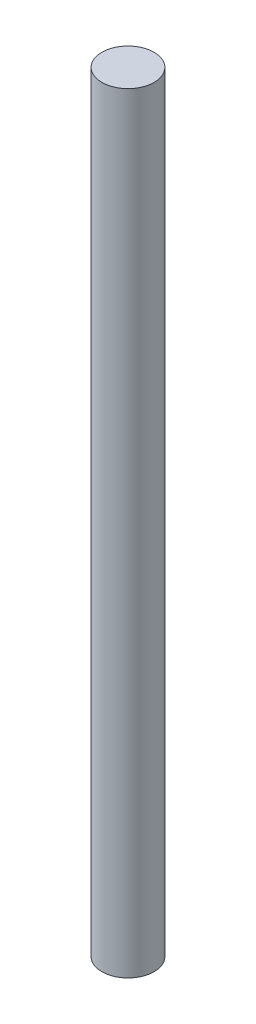
ISO-10303-21;
HEADER;
FILE_DESCRIPTION(('STEP AP214'),'2;1');
FILE_NAME('part.step','',(''),(''),'','','');
FILE_SCHEMA(('AUTOMOTIVE_DESIGN { 1 0 10303 214 1 1 1 1 }'));
ENDSEC;
DATA;
#1=APPLICATION_CONTEXT('core data for automotive mechanical design processes');
#2=APPLICATION_PROTOCOL_DEFINITION('international standard','automotive_design',2000,#1);
#3=PRODUCT_CONTEXT('',#1,'mechanical');
#4=PRODUCT('Part','Part','',(#3));
#5=PRODUCT_RELATED_PRODUCT_CATEGORY('part','',(#4));
#6=PRODUCT_DEFINITION_FORMATION('','',#4);
#7=PRODUCT_DEFINITION_CONTEXT('part definition',#1,'design');
#8=PRODUCT_DEFINITION('design','',#6,#7);
#9=PRODUCT_DEFINITION_SHAPE('','',#8);
#10=(LENGTH_UNIT() NAMED_UNIT(*) SI_UNIT(.MILLI.,.METRE.));
#11=(NAMED_UNIT(*) PLANE_ANGLE_UNIT() SI_UNIT($,.RADIAN.));
#12=(NAMED_UNIT(*) SI_UNIT($,.STERADIAN.) SOLID_ANGLE_UNIT());
#13=UNCERTAINTY_MEASURE_WITH_UNIT(LENGTH_MEASURE(1.E-05),#10,'distance_accuracy_value','');
#14=(GEOMETRIC_REPRESENTATION_CONTEXT(3) GLOBAL_UNCERTAINTY_ASSIGNED_CONTEXT((#13)) GLOBAL_UNIT_ASSIGNED_CONTEXT((#10,
#11,#12)) REPRESENTATION_CONTEXT('',''));
#15=CARTESIAN_POINT('',(0.,0.,0.));
#16=DIRECTION('',(0.,0.,1.));
#17=DIRECTION('',(1.,0.,0.));
#18=AXIS2_PLACEMENT_3D('',#15,#16,#17);
#19=CARTESIAN_POINT('',(0.,59.,0.));
#20=DIRECTION('',(0.,-1.,0.));
#21=DIRECTION('',(0.,0.,-1.));
#22=AXIS2_PLACEMENT_3D('',#19,#20,#21);
#23=CYLINDRICAL_SURFACE('',#22,2.);
#24=CARTESIAN_POINT('',(0.,59.,0.));
#25=DIRECTION('',(0.,1.,0.));
#26=DIRECTION('',(0.,0.,1.));
#27=AXIS2_PLACEMENT_3D('',#24,#25,#26);
#28=CIRCLE('',#27,2.);
#29=CARTESIAN_POINT('',(0.,59.,2.));
#30=VERTEX_POINT('',#29);
#31=EDGE_CURVE('E10',#30,#30,#28,.T.);
#32=ORIENTED_EDGE('',*,*,#31,.F.);
#33=EDGE_LOOP('',(#32));
#34=FACE_BOUND('',#33,.T.);
#35=CARTESIAN_POINT('',(0.,0.,0.));
#36=DIRECTION('',(0.,1.,0.));
#37=DIRECTION('',(0.,0.,1.));
#38=AXIS2_PLACEMENT_3D('',#35,#36,#37);
#39=CIRCLE('',#38,2.);
#40=CARTESIAN_POINT('',(0.,0.,2.));
#41=VERTEX_POINT('',#40);
#42=EDGE_CURVE('E41',#41,#41,#39,.T.);
#43=ORIENTED_EDGE('',*,*,#42,.T.);
#44=EDGE_LOOP('',(#43));
#45=FACE_BOUND('',#44,.T.);
#46=ADVANCED_FACE('F38',(#34,#45),#23,.T.);
#47=CARTESIAN_POINT('',(0.,59.,0.));
#48=DIRECTION('',(0.,1.,0.));
#49=DIRECTION('',(0.,0.,1.));
#50=AXIS2_PLACEMENT_3D('',#47,#48,#49);
#51=PLANE('',#50);
#52=ORIENTED_EDGE('',*,*,#31,.T.);
#53=EDGE_LOOP('',(#52));
#54=FACE_BOUND('',#53,.T.);
#55=ADVANCED_FACE('F57',(#54),#51,.T.);
#56=CARTESIAN_POINT('',(0.,0.,0.));
#57=DIRECTION('',(0.,1.,0.));
#58=DIRECTION('',(0.,0.,1.));
#59=AXIS2_PLACEMENT_3D('',#56,#57,#58);
#60=PLANE('',#59);
#61=ORIENTED_EDGE('',*,*,#42,.F.);
#62=EDGE_LOOP('',(#61));
#63=FACE_BOUND('',#62,.T.);
#64=ADVANCED_FACE('F55',(#63),#60,.F.);
#65=CLOSED_SHELL('',(#46,#55,#64));
#66=MANIFOLD_SOLID_BREP('B2',#65);
#67=ADVANCED_BREP_SHAPE_REPRESENTATION('',(#18,#66),#14);
#68=SHAPE_DEFINITION_REPRESENTATION(#9,#67);
ENDSEC;
END-ISO-10303-21;
